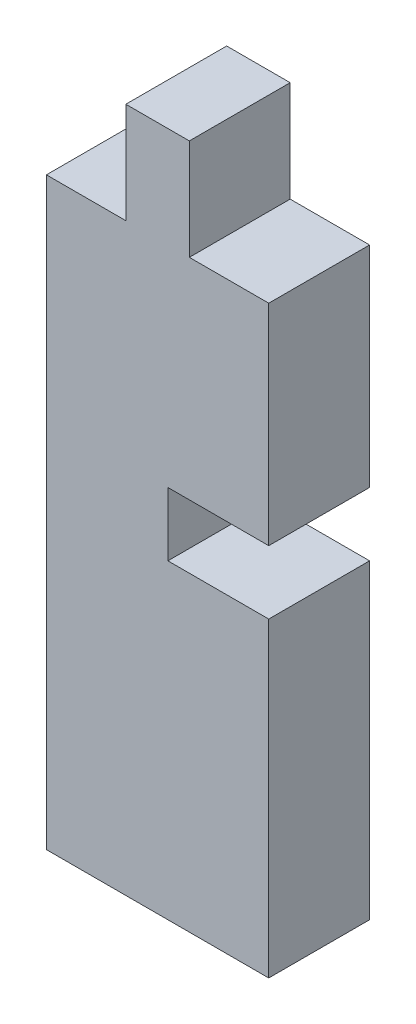
ISO-10303-21;
HEADER;
FILE_DESCRIPTION(('STEP AP214'),'2;1');
FILE_NAME('part.step','',(''),(''),'','','');
FILE_SCHEMA(('AUTOMOTIVE_DESIGN { 1 0 10303 214 1 1 1 1 }'));
ENDSEC;
DATA;
#1=APPLICATION_CONTEXT('core data for automotive mechanical design processes');
#2=APPLICATION_PROTOCOL_DEFINITION('international standard','automotive_design',2000,#1);
#3=PRODUCT_CONTEXT('',#1,'mechanical');
#4=PRODUCT('Part','Part','',(#3));
#5=PRODUCT_RELATED_PRODUCT_CATEGORY('part','',(#4));
#6=PRODUCT_DEFINITION_FORMATION('','',#4);
#7=PRODUCT_DEFINITION_CONTEXT('part definition',#1,'design');
#8=PRODUCT_DEFINITION('design','',#6,#7);
#9=PRODUCT_DEFINITION_SHAPE('','',#8);
#10=(LENGTH_UNIT() NAMED_UNIT(*) SI_UNIT(.MILLI.,.METRE.));
#11=(NAMED_UNIT(*) PLANE_ANGLE_UNIT() SI_UNIT($,.RADIAN.));
#12=(NAMED_UNIT(*) SI_UNIT($,.STERADIAN.) SOLID_ANGLE_UNIT());
#13=UNCERTAINTY_MEASURE_WITH_UNIT(LENGTH_MEASURE(1.E-05),#10,'distance_accuracy_value','');
#14=(GEOMETRIC_REPRESENTATION_CONTEXT(3) GLOBAL_UNCERTAINTY_ASSIGNED_CONTEXT((#13)) GLOBAL_UNIT_ASSIGNED_CONTEXT((#10,
#11,#12)) REPRESENTATION_CONTEXT('',''));
#15=CARTESIAN_POINT('',(0.,0.,0.));
#16=DIRECTION('',(0.,0.,1.));
#17=DIRECTION('',(1.,0.,0.));
#18=AXIS2_PLACEMENT_3D('',#15,#16,#17);
#19=CARTESIAN_POINT('',(0.325000000000002,0.,3.175));
#20=DIRECTION('',(1.,0.,0.));
#21=DIRECTION('',(0.,0.,-1.));
#22=AXIS2_PLACEMENT_3D('',#19,#20,#21);
#23=PLANE('',#22);
#24=DIRECTION('',(0.,-1.,0.));
#25=VECTOR('',#24,1.);
#26=CARTESIAN_POINT('',(0.325000000000002,0.,0.));
#27=LINE('',#26,#25);
#28=CARTESIAN_POINT('',(0.325000000000002,1.,0.));
#29=VERTEX_POINT('',#28);
#30=CARTESIAN_POINT('',(0.325000000000002,-1.,0.));
#31=VERTEX_POINT('',#30);
#32=EDGE_CURVE('E166',#29,#31,#27,.T.);
#33=ORIENTED_EDGE('',*,*,#32,.F.);
#34=DIRECTION('',(0.,0.,-1.));
#35=VECTOR('',#34,1.);
#36=CARTESIAN_POINT('',(0.325000000000002,1.,3.175));
#37=LINE('',#36,#35);
#38=CARTESIAN_POINT('',(0.325000000000002,1.,3.175));
#39=VERTEX_POINT('',#38);
#40=EDGE_CURVE('E11',#39,#29,#37,.T.);
#41=ORIENTED_EDGE('',*,*,#40,.F.);
#42=DIRECTION('',(0.,-1.,0.));
#43=VECTOR('',#42,1.);
#44=CARTESIAN_POINT('',(0.325000000000002,0.,3.175));
#45=LINE('',#44,#43);
#46=CARTESIAN_POINT('',(0.325000000000002,-1.,3.175));
#47=VERTEX_POINT('',#46);
#48=EDGE_CURVE('E203',#39,#47,#45,.T.);
#49=ORIENTED_EDGE('',*,*,#48,.T.);
#50=DIRECTION('',(0.,0.,-1.));
#51=VECTOR('',#50,1.);
#52=CARTESIAN_POINT('',(0.325000000000002,-1.,3.175));
#53=LINE('',#52,#51);
#54=EDGE_CURVE('E104',#47,#31,#53,.T.);
#55=ORIENTED_EDGE('',*,*,#54,.T.);
#56=EDGE_LOOP('',(#33,#41,#49,#55));
#57=FACE_BOUND('',#56,.T.);
#58=ADVANCED_FACE('F41',(#57),#23,.T.);
#59=CARTESIAN_POINT('',(0.,1.,3.175));
#60=DIRECTION('',(0.,-1.,0.));
#61=DIRECTION('',(1.,0.,0.));
#62=AXIS2_PLACEMENT_3D('',#59,#60,#61);
#63=PLANE('',#62);
#64=DIRECTION('',(-1.,0.,0.));
#65=VECTOR('',#64,1.);
#66=CARTESIAN_POINT('',(0.,1.,0.));
#67=LINE('',#66,#65);
#68=CARTESIAN_POINT('',(3.5,1.,0.));
#69=VERTEX_POINT('',#68);
#70=EDGE_CURVE('E170',#69,#29,#67,.T.);
#71=ORIENTED_EDGE('',*,*,#70,.F.);
#72=DIRECTION('',(0.,0.,-1.));
#73=VECTOR('',#72,1.);
#74=CARTESIAN_POINT('',(3.5,1.,3.175));
#75=LINE('',#74,#73);
#76=CARTESIAN_POINT('',(3.5,1.,3.175));
#77=VERTEX_POINT('',#76);
#78=EDGE_CURVE('E50',#77,#69,#75,.T.);
#79=ORIENTED_EDGE('',*,*,#78,.F.);
#80=DIRECTION('',(-1.,0.,0.));
#81=VECTOR('',#80,1.);
#82=CARTESIAN_POINT('',(0.,1.,3.175));
#83=LINE('',#82,#81);
#84=EDGE_CURVE('E242',#77,#39,#83,.T.);
#85=ORIENTED_EDGE('',*,*,#84,.T.);
#86=ORIENTED_EDGE('',*,*,#40,.T.);
#87=EDGE_LOOP('',(#71,#79,#85,#86));
#88=FACE_BOUND('',#87,.T.);
#89=ADVANCED_FACE('F241',(#88),#63,.T.);
#90=CARTESIAN_POINT('',(3.5,0.,3.175));
#91=DIRECTION('',(-1.,0.,0.));
#92=DIRECTION('',(0.,-1.,0.));
#93=AXIS2_PLACEMENT_3D('',#90,#91,#92);
#94=PLANE('',#93);
#95=DIRECTION('',(0.,1.,0.));
#96=VECTOR('',#95,1.);
#97=CARTESIAN_POINT('',(3.5,0.,0.));
#98=LINE('',#97,#96);
#99=CARTESIAN_POINT('',(3.5,7.61249429999999,0.));
#100=VERTEX_POINT('',#99);
#101=EDGE_CURVE('E174',#69,#100,#98,.T.);
#102=ORIENTED_EDGE('',*,*,#101,.T.);
#103=DIRECTION('',(0.,0.,-1.));
#104=VECTOR('',#103,1.);
#105=CARTESIAN_POINT('',(3.5,7.61249429999999,3.175));
#106=LINE('',#105,#104);
#107=CARTESIAN_POINT('',(3.5,7.61249429999999,3.175));
#108=VERTEX_POINT('',#107);
#109=EDGE_CURVE('E226',#108,#100,#106,.T.);
#110=ORIENTED_EDGE('',*,*,#109,.F.);
#111=DIRECTION('',(0.,1.,0.));
#112=VECTOR('',#111,1.);
#113=CARTESIAN_POINT('',(3.5,0.,3.175));
#114=LINE('',#113,#112);
#115=EDGE_CURVE('E151',#77,#108,#114,.T.);
#116=ORIENTED_EDGE('',*,*,#115,.F.);
#117=ORIENTED_EDGE('',*,*,#78,.T.);
#118=EDGE_LOOP('',(#102,#110,#116,#117));
#119=FACE_BOUND('',#118,.T.);
#120=ADVANCED_FACE('F232',(#119),#94,.F.);
#121=CARTESIAN_POINT('',(0.,7.61249429999999,3.175));
#122=DIRECTION('',(0.,1.,0.));
#123=DIRECTION('',(-1.,0.,0.));
#124=AXIS2_PLACEMENT_3D('',#121,#122,#123);
#125=PLANE('',#124);
#126=DIRECTION('',(1.,0.,0.));
#127=VECTOR('',#126,1.);
#128=CARTESIAN_POINT('',(0.,7.61249429999999,0.));
#129=LINE('',#128,#127);
#130=CARTESIAN_POINT('',(1.,7.61249429999999,0.));
#131=VERTEX_POINT('',#130);
#132=EDGE_CURVE('E178',#131,#100,#129,.T.);
#133=ORIENTED_EDGE('',*,*,#132,.F.);
#134=DIRECTION('',(0.,0.,-1.));
#135=VECTOR('',#134,1.);
#136=CARTESIAN_POINT('',(1.,7.61249429999999,3.175));
#137=LINE('',#136,#135);
#138=CARTESIAN_POINT('',(1.,7.61249429999999,3.175));
#139=VERTEX_POINT('',#138);
#140=EDGE_CURVE('E223',#139,#131,#137,.T.);
#141=ORIENTED_EDGE('',*,*,#140,.F.);
#142=DIRECTION('',(1.,0.,0.));
#143=VECTOR('',#142,1.);
#144=CARTESIAN_POINT('',(0.,7.61249429999999,3.175));
#145=LINE('',#144,#143);
#146=EDGE_CURVE('E252',#139,#108,#145,.T.);
#147=ORIENTED_EDGE('',*,*,#146,.T.);
#148=ORIENTED_EDGE('',*,*,#109,.T.);
#149=EDGE_LOOP('',(#133,#141,#147,#148));
#150=FACE_BOUND('',#149,.T.);
#151=ADVANCED_FACE('F291',(#150),#125,.T.);
#152=CARTESIAN_POINT('',(1.,0.,3.175));
#153=DIRECTION('',(1.,0.,0.));
#154=DIRECTION('',(0.,1.,0.));
#155=AXIS2_PLACEMENT_3D('',#152,#153,#154);
#156=PLANE('',#155);
#157=DIRECTION('',(0.,-1.,0.));
#158=VECTOR('',#157,1.);
#159=CARTESIAN_POINT('',(1.,0.,0.));
#160=LINE('',#159,#158);
#161=CARTESIAN_POINT('',(0.999999999999999,10.7874943,0.));
#162=VERTEX_POINT('',#161);
#163=EDGE_CURVE('E182',#162,#131,#160,.T.);
#164=ORIENTED_EDGE('',*,*,#163,.F.);
#165=DIRECTION('',(0.,0.,-1.));
#166=VECTOR('',#165,1.);
#167=CARTESIAN_POINT('',(0.999999999999999,10.7874943,3.175));
#168=LINE('',#167,#166);
#169=CARTESIAN_POINT('',(0.999999999999999,10.7874943,3.175));
#170=VERTEX_POINT('',#169);
#171=EDGE_CURVE('E220',#170,#162,#168,.T.);
#172=ORIENTED_EDGE('',*,*,#171,.F.);
#173=DIRECTION('',(0.,-1.,0.));
#174=VECTOR('',#173,1.);
#175=CARTESIAN_POINT('',(1.,0.,3.175));
#176=LINE('',#175,#174);
#177=EDGE_CURVE('E256',#170,#139,#176,.T.);
#178=ORIENTED_EDGE('',*,*,#177,.T.);
#179=ORIENTED_EDGE('',*,*,#140,.T.);
#180=EDGE_LOOP('',(#164,#172,#178,#179));
#181=FACE_BOUND('',#180,.T.);
#182=ADVANCED_FACE('F288',(#181),#156,.T.);
#183=CARTESIAN_POINT('',(0.,10.7874943,3.175));
#184=DIRECTION('',(0.,-1.,0.));
#185=DIRECTION('',(1.,0.,0.));
#186=AXIS2_PLACEMENT_3D('',#183,#184,#185);
#187=PLANE('',#186);
#188=DIRECTION('',(-1.,0.,0.));
#189=VECTOR('',#188,1.);
#190=CARTESIAN_POINT('',(0.,10.7874943,0.));
#191=LINE('',#190,#189);
#192=CARTESIAN_POINT('',(-1.,10.7874943,0.));
#193=VERTEX_POINT('',#192);
#194=EDGE_CURVE('E187',#162,#193,#191,.T.);
#195=ORIENTED_EDGE('',*,*,#194,.T.);
#196=DIRECTION('',(0.,0.,-1.));
#197=VECTOR('',#196,1.);
#198=CARTESIAN_POINT('',(-1.,10.7874943,3.175));
#199=LINE('',#198,#197);
#200=CARTESIAN_POINT('',(-1.,10.7874943,3.175));
#201=VERTEX_POINT('',#200);
#202=EDGE_CURVE('E216',#201,#193,#199,.T.);
#203=ORIENTED_EDGE('',*,*,#202,.F.);
#204=DIRECTION('',(-1.,0.,0.));
#205=VECTOR('',#204,1.);
#206=CARTESIAN_POINT('',(0.,10.7874943,3.175));
#207=LINE('',#206,#205);
#208=EDGE_CURVE('E260',#170,#201,#207,.T.);
#209=ORIENTED_EDGE('',*,*,#208,.F.);
#210=ORIENTED_EDGE('',*,*,#171,.T.);
#211=EDGE_LOOP('',(#195,#203,#209,#210));
#212=FACE_BOUND('',#211,.T.);
#213=ADVANCED_FACE('F285',(#212),#187,.F.);
#214=CARTESIAN_POINT('',(-0.999999999999999,0.,3.175));
#215=DIRECTION('',(1.,0.,0.));
#216=DIRECTION('',(0.,1.,0.));
#217=AXIS2_PLACEMENT_3D('',#214,#215,#216);
#218=PLANE('',#217);
#219=DIRECTION('',(0.,-1.,0.));
#220=VECTOR('',#219,1.);
#221=CARTESIAN_POINT('',(-0.999999999999999,0.,0.));
#222=LINE('',#221,#220);
#223=CARTESIAN_POINT('',(-1.,7.61249429999999,0.));
#224=VERTEX_POINT('',#223);
#225=EDGE_CURVE('E190',#193,#224,#222,.T.);
#226=ORIENTED_EDGE('',*,*,#225,.T.);
#227=DIRECTION('',(0.,0.,-1.));
#228=VECTOR('',#227,1.);
#229=CARTESIAN_POINT('',(-1.,7.61249429999999,3.175));
#230=LINE('',#229,#228);
#231=CARTESIAN_POINT('',(-1.,7.61249429999999,3.175));
#232=VERTEX_POINT('',#231);
#233=EDGE_CURVE('E213',#232,#224,#230,.T.);
#234=ORIENTED_EDGE('',*,*,#233,.F.);
#235=DIRECTION('',(0.,-1.,0.));
#236=VECTOR('',#235,1.);
#237=CARTESIAN_POINT('',(-0.999999999999999,0.,3.175));
#238=LINE('',#237,#236);
#239=EDGE_CURVE('E262',#201,#232,#238,.T.);
#240=ORIENTED_EDGE('',*,*,#239,.F.);
#241=ORIENTED_EDGE('',*,*,#202,.T.);
#242=EDGE_LOOP('',(#226,#234,#240,#241));
#243=FACE_BOUND('',#242,.T.);
#244=ADVANCED_FACE('F281',(#243),#218,.F.);
#245=CARTESIAN_POINT('',(-3.5,7.61249429999999,0.));
#246=VERTEX_POINT('',#245);
#247=EDGE_CURVE('E183',#246,#224,#129,.T.);
#248=ORIENTED_EDGE('',*,*,#247,.F.);
#249=DIRECTION('',(0.,0.,-1.));
#250=VECTOR('',#249,1.);
#251=CARTESIAN_POINT('',(-3.5,7.61249429999999,3.175));
#252=LINE('',#251,#250);
#253=CARTESIAN_POINT('',(-3.5,7.61249429999999,3.175));
#254=VERTEX_POINT('',#253);
#255=EDGE_CURVE('E210',#254,#246,#252,.T.);
#256=ORIENTED_EDGE('',*,*,#255,.F.);
#257=EDGE_CURVE('E160',#254,#232,#145,.T.);
#258=ORIENTED_EDGE('',*,*,#257,.T.);
#259=ORIENTED_EDGE('',*,*,#233,.T.);
#260=EDGE_LOOP('',(#248,#256,#258,#259));
#261=FACE_BOUND('',#260,.T.);
#262=ADVANCED_FACE('F270',(#261),#125,.T.);
#263=CARTESIAN_POINT('',(-3.5,0.,3.175));
#264=DIRECTION('',(-1.,0.,0.));
#265=DIRECTION('',(0.,-1.,0.));
#266=AXIS2_PLACEMENT_3D('',#263,#264,#265);
#267=PLANE('',#266);
#268=DIRECTION('',(0.,1.,0.));
#269=VECTOR('',#268,1.);
#270=CARTESIAN_POINT('',(-3.5,0.,0.));
#271=LINE('',#270,#269);
#272=CARTESIAN_POINT('',(-3.5,-10.7874943,0.));
#273=VERTEX_POINT('',#272);
#274=EDGE_CURVE('E194',#273,#246,#271,.T.);
#275=ORIENTED_EDGE('',*,*,#274,.F.);
#276=DIRECTION('',(0.,0.,-1.));
#277=VECTOR('',#276,1.);
#278=CARTESIAN_POINT('',(-3.5,-10.7874943,3.175));
#279=LINE('',#278,#277);
#280=CARTESIAN_POINT('',(-3.5,-10.7874943,3.175));
#281=VERTEX_POINT('',#280);
#282=EDGE_CURVE('E144',#281,#273,#279,.T.);
#283=ORIENTED_EDGE('',*,*,#282,.F.);
#284=DIRECTION('',(0.,1.,0.));
#285=VECTOR('',#284,1.);
#286=CARTESIAN_POINT('',(-3.5,0.,3.175));
#287=LINE('',#286,#285);
#288=EDGE_CURVE('E156',#281,#254,#287,.T.);
#289=ORIENTED_EDGE('',*,*,#288,.T.);
#290=ORIENTED_EDGE('',*,*,#255,.T.);
#291=EDGE_LOOP('',(#275,#283,#289,#290));
#292=FACE_BOUND('',#291,.T.);
#293=ADVANCED_FACE('F273',(#292),#267,.T.);
#294=CARTESIAN_POINT('',(0.,-10.7874943,3.175));
#295=DIRECTION('',(0.,-1.,0.));
#296=DIRECTION('',(1.,0.,0.));
#297=AXIS2_PLACEMENT_3D('',#294,#295,#296);
#298=PLANE('',#297);
#299=DIRECTION('',(-1.,0.,0.));
#300=VECTOR('',#299,1.);
#301=CARTESIAN_POINT('',(0.,-10.7874943,0.));
#302=LINE('',#301,#300);
#303=CARTESIAN_POINT('',(3.5,-10.7874943,0.));
#304=VERTEX_POINT('',#303);
#305=EDGE_CURVE('E142',#304,#273,#302,.T.);
#306=ORIENTED_EDGE('',*,*,#305,.F.);
#307=DIRECTION('',(0.,0.,-1.));
#308=VECTOR('',#307,1.);
#309=CARTESIAN_POINT('',(3.5,-10.7874943,3.175));
#310=LINE('',#309,#308);
#311=CARTESIAN_POINT('',(3.5,-10.7874943,3.175));
#312=VERTEX_POINT('',#311);
#313=EDGE_CURVE('E136',#312,#304,#310,.T.);
#314=ORIENTED_EDGE('',*,*,#313,.F.);
#315=DIRECTION('',(-1.,0.,0.));
#316=VECTOR('',#315,1.);
#317=CARTESIAN_POINT('',(0.,-10.7874943,3.175));
#318=LINE('',#317,#316);
#319=EDGE_CURVE('E140',#312,#281,#318,.T.);
#320=ORIENTED_EDGE('',*,*,#319,.T.);
#321=ORIENTED_EDGE('',*,*,#282,.T.);
#322=EDGE_LOOP('',(#306,#314,#320,#321));
#323=FACE_BOUND('',#322,.T.);
#324=ADVANCED_FACE('F138',(#323),#298,.T.);
#325=CARTESIAN_POINT('',(3.5,-0.999999999999999,0.));
#326=VERTEX_POINT('',#325);
#327=EDGE_CURVE('E97',#304,#326,#98,.T.);
#328=ORIENTED_EDGE('',*,*,#327,.T.);
#329=DIRECTION('',(0.,0.,-1.));
#330=VECTOR('',#329,1.);
#331=CARTESIAN_POINT('',(3.5,-0.999999999999999,3.175));
#332=LINE('',#331,#330);
#333=CARTESIAN_POINT('',(3.5,-0.999999999999999,3.175));
#334=VERTEX_POINT('',#333);
#335=EDGE_CURVE('E145',#334,#326,#332,.T.);
#336=ORIENTED_EDGE('',*,*,#335,.F.);
#337=EDGE_CURVE('E147',#312,#334,#114,.T.);
#338=ORIENTED_EDGE('',*,*,#337,.F.);
#339=ORIENTED_EDGE('',*,*,#313,.T.);
#340=EDGE_LOOP('',(#328,#336,#338,#339));
#341=FACE_BOUND('',#340,.T.);
#342=ADVANCED_FACE('F148',(#341),#94,.F.);
#343=CARTESIAN_POINT('',(0.,-1.,3.175));
#344=DIRECTION('',(0.,-1.,0.));
#345=DIRECTION('',(1.,0.,0.));
#346=AXIS2_PLACEMENT_3D('',#343,#344,#345);
#347=PLANE('',#346);
#348=DIRECTION('',(-1.,0.,0.));
#349=VECTOR('',#348,1.);
#350=CARTESIAN_POINT('',(0.,-1.,0.));
#351=LINE('',#350,#349);
#352=EDGE_CURVE('E200',#326,#31,#351,.T.);
#353=ORIENTED_EDGE('',*,*,#352,.T.);
#354=ORIENTED_EDGE('',*,*,#54,.F.);
#355=DIRECTION('',(-1.,0.,0.));
#356=VECTOR('',#355,1.);
#357=CARTESIAN_POINT('',(0.,-1.,3.175));
#358=LINE('',#357,#356);
#359=EDGE_CURVE('E58',#334,#47,#358,.T.);
#360=ORIENTED_EDGE('',*,*,#359,.F.);
#361=ORIENTED_EDGE('',*,*,#335,.T.);
#362=EDGE_LOOP('',(#353,#354,#360,#361));
#363=FACE_BOUND('',#362,.T.);
#364=ADVANCED_FACE('F245',(#363),#347,.F.);
#365=CARTESIAN_POINT('',(0.,0.,3.175));
#366=DIRECTION('',(0.,0.,1.));
#367=DIRECTION('',(1.,0.,0.));
#368=AXIS2_PLACEMENT_3D('',#365,#366,#367);
#369=PLANE('',#368);
#370=ORIENTED_EDGE('',*,*,#48,.F.);
#371=ORIENTED_EDGE('',*,*,#84,.F.);
#372=ORIENTED_EDGE('',*,*,#115,.T.);
#373=ORIENTED_EDGE('',*,*,#146,.F.);
#374=ORIENTED_EDGE('',*,*,#177,.F.);
#375=ORIENTED_EDGE('',*,*,#208,.T.);
#376=ORIENTED_EDGE('',*,*,#239,.T.);
#377=ORIENTED_EDGE('',*,*,#257,.F.);
#378=ORIENTED_EDGE('',*,*,#288,.F.);
#379=ORIENTED_EDGE('',*,*,#319,.F.);
#380=ORIENTED_EDGE('',*,*,#337,.T.);
#381=ORIENTED_EDGE('',*,*,#359,.T.);
#382=EDGE_LOOP('',(#370,#371,#372,#373,#374,#375,#376,#377,#378,#379,#380,#381));
#383=FACE_BOUND('',#382,.T.);
#384=ADVANCED_FACE('F153',(#383),#369,.T.);
#385=CARTESIAN_POINT('',(0.,0.,0.));
#386=DIRECTION('',(0.,0.,1.));
#387=DIRECTION('',(1.,0.,0.));
#388=AXIS2_PLACEMENT_3D('',#385,#386,#387);
#389=PLANE('',#388);
#390=ORIENTED_EDGE('',*,*,#32,.T.);
#391=ORIENTED_EDGE('',*,*,#352,.F.);
#392=ORIENTED_EDGE('',*,*,#327,.F.);
#393=ORIENTED_EDGE('',*,*,#305,.T.);
#394=ORIENTED_EDGE('',*,*,#274,.T.);
#395=ORIENTED_EDGE('',*,*,#247,.T.);
#396=ORIENTED_EDGE('',*,*,#225,.F.);
#397=ORIENTED_EDGE('',*,*,#194,.F.);
#398=ORIENTED_EDGE('',*,*,#163,.T.);
#399=ORIENTED_EDGE('',*,*,#132,.T.);
#400=ORIENTED_EDGE('',*,*,#101,.F.);
#401=ORIENTED_EDGE('',*,*,#70,.T.);
#402=EDGE_LOOP('',(#390,#391,#392,#393,#394,#395,#396,#397,#398,#399,#400,#401));
#403=FACE_BOUND('',#402,.T.);
#404=ADVANCED_FACE('F239',(#403),#389,.F.);
#405=CLOSED_SHELL('',(#58,#89,#120,#151,#182,#213,#244,#262,#293,#324,#342,#364,#384,#404));
#406=MANIFOLD_SOLID_BREP('B2',#405);
#407=ADVANCED_BREP_SHAPE_REPRESENTATION('',(#18,#406),#14);
#408=SHAPE_DEFINITION_REPRESENTATION(#9,#407);
ENDSEC;
END-ISO-10303-21;
